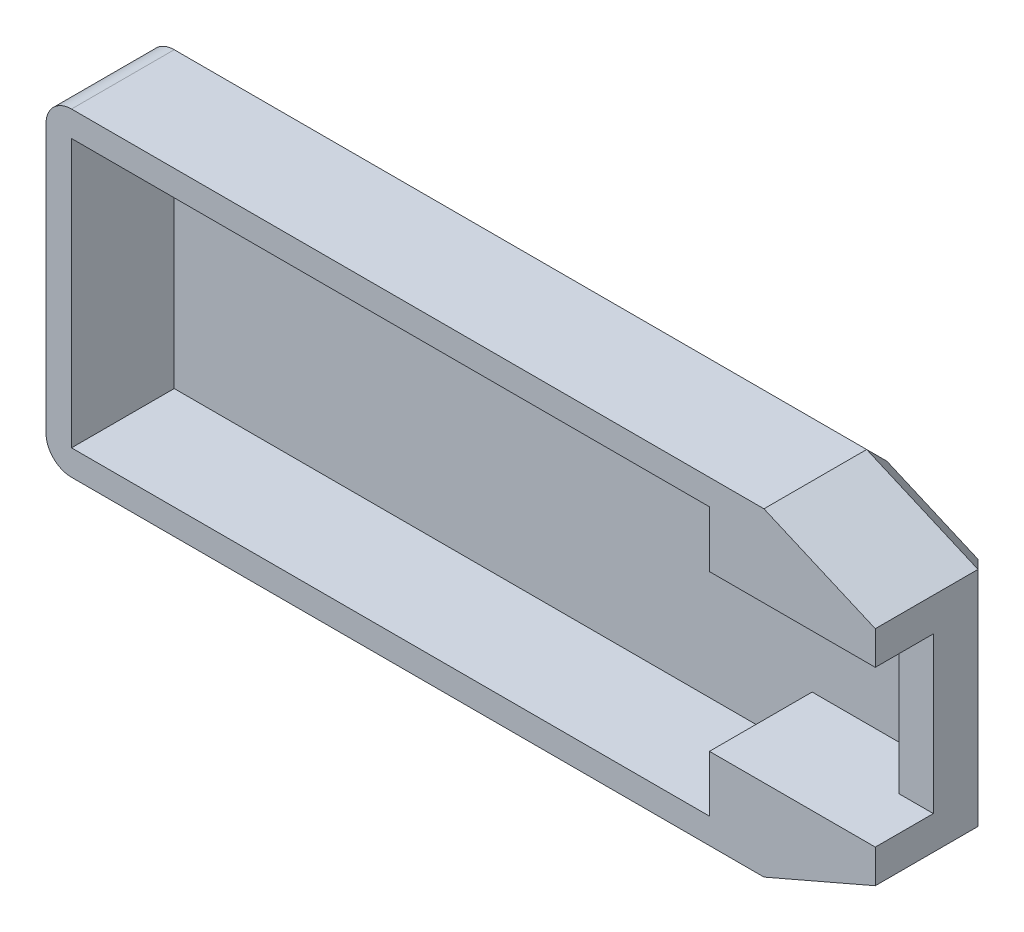
ISO-10303-21;
HEADER;
FILE_DESCRIPTION(('STEP AP214'),'2;1');
FILE_NAME('part.step','',(''),(''),'','','');
FILE_SCHEMA(('AUTOMOTIVE_DESIGN { 1 0 10303 214 1 1 1 1 }'));
ENDSEC;
DATA;
#1=APPLICATION_CONTEXT('core data for automotive mechanical design processes');
#2=APPLICATION_PROTOCOL_DEFINITION('international standard','automotive_design',2000,#1);
#3=PRODUCT_CONTEXT('',#1,'mechanical');
#4=PRODUCT('Part','Part','',(#3));
#5=PRODUCT_RELATED_PRODUCT_CATEGORY('part','',(#4));
#6=PRODUCT_DEFINITION_FORMATION('','',#4);
#7=PRODUCT_DEFINITION_CONTEXT('part definition',#1,'design');
#8=PRODUCT_DEFINITION('design','',#6,#7);
#9=PRODUCT_DEFINITION_SHAPE('','',#8);
#10=(LENGTH_UNIT() NAMED_UNIT(*) SI_UNIT(.MILLI.,.METRE.));
#11=(NAMED_UNIT(*) PLANE_ANGLE_UNIT() SI_UNIT($,.RADIAN.));
#12=(NAMED_UNIT(*) SI_UNIT($,.STERADIAN.) SOLID_ANGLE_UNIT());
#13=UNCERTAINTY_MEASURE_WITH_UNIT(LENGTH_MEASURE(1.E-05),#10,'distance_accuracy_value','');
#14=(GEOMETRIC_REPRESENTATION_CONTEXT(3) GLOBAL_UNCERTAINTY_ASSIGNED_CONTEXT((#13)) GLOBAL_UNIT_ASSIGNED_CONTEXT((#10,
#11,#12)) REPRESENTATION_CONTEXT('',''));
#15=CARTESIAN_POINT('',(0.,0.,0.));
#16=DIRECTION('',(0.,0.,1.));
#17=DIRECTION('',(1.,0.,0.));
#18=AXIS2_PLACEMENT_3D('',#15,#16,#17);
#19=CARTESIAN_POINT('',(-18.703125,13.70078125,2.));
#20=DIRECTION('',(1.,0.,0.));
#21=DIRECTION('',(0.,1.,0.));
#22=AXIS2_PLACEMENT_3D('',#19,#20,#21);
#23=PLANE('',#22);
#24=DIRECTION('',(0.,0.,-1.));
#25=VECTOR('',#24,1.);
#26=CARTESIAN_POINT('',(-18.703125,11.70078125,2.));
#27=LINE('',#26,#25);
#28=CARTESIAN_POINT('',(-18.703125,11.70078125,10.05));
#29=VERTEX_POINT('',#28);
#30=CARTESIAN_POINT('',(-18.703125,11.70078125,2.));
#31=VERTEX_POINT('',#30);
#32=EDGE_CURVE('E300',#29,#31,#27,.T.);
#33=ORIENTED_EDGE('',*,*,#32,.T.);
#34=DIRECTION('',(0.,-1.,0.));
#35=VECTOR('',#34,1.);
#36=CARTESIAN_POINT('',(-18.703125,13.70078125,2.));
#37=LINE('',#36,#35);
#38=CARTESIAN_POINT('',(-18.703125,-9.29921875,2.00000000000001));
#39=VERTEX_POINT('',#38);
#40=EDGE_CURVE('E321',#31,#39,#37,.T.);
#41=ORIENTED_EDGE('',*,*,#40,.T.);
#42=DIRECTION('',(0.,0.,-1.));
#43=VECTOR('',#42,1.);
#44=CARTESIAN_POINT('',(-18.703125,-9.29921875,2.));
#45=LINE('',#44,#43);
#46=CARTESIAN_POINT('',(-18.703125,-9.29921875,10.05));
#47=VERTEX_POINT('',#46);
#48=EDGE_CURVE('E303',#39,#47,#45,.F.);
#49=ORIENTED_EDGE('',*,*,#48,.T.);
#50=DIRECTION('',(0.,-1.,0.));
#51=VECTOR('',#50,1.);
#52=CARTESIAN_POINT('',(-18.703125,13.70078125,10.05));
#53=LINE('',#52,#51);
#54=EDGE_CURVE('E193',#29,#47,#53,.T.);
#55=ORIENTED_EDGE('',*,*,#54,.F.);
#56=EDGE_LOOP('',(#33,#41,#49,#55));
#57=FACE_BOUND('',#56,.T.);
#58=ADVANCED_FACE('F35',(#57),#23,.F.);
#59=CARTESIAN_POINT('',(-18.703125,-11.29921875,2.));
#60=DIRECTION('',(0.,1.,0.));
#61=DIRECTION('',(-1.,0.,0.));
#62=AXIS2_PLACEMENT_3D('',#59,#60,#61);
#63=PLANE('',#62);
#64=DIRECTION('',(0.,0.,-1.));
#65=VECTOR('',#64,1.);
#66=CARTESIAN_POINT('',(-16.703125,-11.29921875,2.));
#67=LINE('',#66,#65);
#68=CARTESIAN_POINT('',(-16.703125,-11.29921875,10.05));
#69=VERTEX_POINT('',#68);
#70=CARTESIAN_POINT('',(-16.703125,-11.29921875,2.));
#71=VERTEX_POINT('',#70);
#72=EDGE_CURVE('E241',#69,#71,#67,.T.);
#73=ORIENTED_EDGE('',*,*,#72,.T.);
#74=DIRECTION('',(1.,0.,0.));
#75=VECTOR('',#74,1.);
#76=CARTESIAN_POINT('',(-18.703125,-11.29921875,2.));
#77=LINE('',#76,#75);
#78=CARTESIAN_POINT('',(37.5703125,-11.29921875,2.));
#79=VERTEX_POINT('',#78);
#80=EDGE_CURVE('E199',#71,#79,#77,.T.);
#81=ORIENTED_EDGE('',*,*,#80,.T.);
#82=DIRECTION('',(0.,0.,-1.));
#83=VECTOR('',#82,1.);
#84=CARTESIAN_POINT('',(37.5703125,-11.29921875,2.));
#85=LINE('',#84,#83);
#86=CARTESIAN_POINT('',(37.5703125,-11.29921875,10.05));
#87=VERTEX_POINT('',#86);
#88=EDGE_CURVE('E196',#87,#79,#85,.T.);
#89=ORIENTED_EDGE('',*,*,#88,.F.);
#90=DIRECTION('',(1.,0.,0.));
#91=VECTOR('',#90,1.);
#92=CARTESIAN_POINT('',(-18.703125,-11.29921875,10.05));
#93=LINE('',#92,#91);
#94=EDGE_CURVE('E181',#69,#87,#93,.T.);
#95=ORIENTED_EDGE('',*,*,#94,.F.);
#96=EDGE_LOOP('',(#73,#81,#89,#95));
#97=FACE_BOUND('',#96,.T.);
#98=ADVANCED_FACE('F197',(#97),#63,.F.);
#99=CARTESIAN_POINT('',(46.296875,-7.52421874999999,2.));
#100=DIRECTION('',(-0.397030883570598,0.91780525030703,0.));
#101=DIRECTION('',(-0.91780525030703,-0.397030883570598,0.));
#102=AXIS2_PLACEMENT_3D('',#99,#100,#101);
#103=PLANE('',#102);
#104=ORIENTED_EDGE('',*,*,#88,.T.);
#105=DIRECTION('',(0.91780525030703,0.397030883570598,0.));
#106=VECTOR('',#105,1.);
#107=CARTESIAN_POINT('',(46.296875,-7.52421874999999,2.));
#108=LINE('',#107,#106);
#109=CARTESIAN_POINT('',(46.296875,-7.52421874999999,2.));
#110=VERTEX_POINT('',#109);
#111=EDGE_CURVE('E45',#79,#110,#108,.T.);
#112=ORIENTED_EDGE('',*,*,#111,.T.);
#113=DIRECTION('',(0.,0.,-1.));
#114=VECTOR('',#113,1.);
#115=CARTESIAN_POINT('',(46.296875,-7.52421874999999,2.));
#116=LINE('',#115,#114);
#117=CARTESIAN_POINT('',(46.296875,-7.52421874999999,10.05));
#118=VERTEX_POINT('',#117);
#119=EDGE_CURVE('E201',#118,#110,#116,.T.);
#120=ORIENTED_EDGE('',*,*,#119,.F.);
#121=DIRECTION('',(0.91780525030703,0.397030883570598,0.));
#122=VECTOR('',#121,1.);
#123=CARTESIAN_POINT('',(37.5703125,-11.29921875,10.05));
#124=LINE('',#123,#122);
#125=EDGE_CURVE('E186',#87,#118,#124,.T.);
#126=ORIENTED_EDGE('',*,*,#125,.F.);
#127=EDGE_LOOP('',(#104,#112,#120,#126));
#128=FACE_BOUND('',#127,.T.);
#129=ADVANCED_FACE('F203',(#128),#103,.F.);
#130=CARTESIAN_POINT('',(46.296875,9.92578124999999,2.));
#131=DIRECTION('',(-1.,0.,0.));
#132=DIRECTION('',(0.,0.,1.));
#133=AXIS2_PLACEMENT_3D('',#130,#131,#132);
#134=PLANE('',#133);
#135=ORIENTED_EDGE('',*,*,#119,.T.);
#136=DIRECTION('',(0.,1.,0.));
#137=VECTOR('',#136,1.);
#138=CARTESIAN_POINT('',(46.296875,9.92578124999999,2.));
#139=LINE('',#138,#137);
#140=CARTESIAN_POINT('',(46.296875,9.92578124999999,2.));
#141=VERTEX_POINT('',#140);
#142=EDGE_CURVE('E346',#110,#141,#139,.T.);
#143=ORIENTED_EDGE('',*,*,#142,.T.);
#144=DIRECTION('',(0.,0.,-1.));
#145=VECTOR('',#144,1.);
#146=CARTESIAN_POINT('',(46.296875,9.92578124999999,2.));
#147=LINE('',#146,#145);
#148=CARTESIAN_POINT('',(46.296875,9.92578124999999,10.05));
#149=VERTEX_POINT('',#148);
#150=EDGE_CURVE('E295',#149,#141,#147,.T.);
#151=ORIENTED_EDGE('',*,*,#150,.F.);
#152=DIRECTION('',(0.,1.,0.));
#153=VECTOR('',#152,1.);
#154=CARTESIAN_POINT('',(46.296875,7.30078125,10.05));
#155=LINE('',#154,#153);
#156=CARTESIAN_POINT('',(46.296875,7.30078125,10.05));
#157=VERTEX_POINT('',#156);
#158=EDGE_CURVE('E229',#157,#149,#155,.T.);
#159=ORIENTED_EDGE('',*,*,#158,.F.);
#160=DIRECTION('',(0.,0.,-1.));
#161=VECTOR('',#160,1.);
#162=CARTESIAN_POINT('',(46.296875,7.30078125,10.05));
#163=LINE('',#162,#161);
#164=CARTESIAN_POINT('',(46.296875,7.30078125,5.5));
#165=VERTEX_POINT('',#164);
#166=EDGE_CURVE('E235',#157,#165,#163,.T.);
#167=ORIENTED_EDGE('',*,*,#166,.T.);
#168=DIRECTION('',(0.,1.,0.));
#169=VECTOR('',#168,1.);
#170=CARTESIAN_POINT('',(46.296875,-7.52421874999999,5.5));
#171=LINE('',#170,#169);
#172=CARTESIAN_POINT('',(46.296875,-4.89921875,5.5));
#173=VERTEX_POINT('',#172);
#174=EDGE_CURVE('E289',#173,#165,#171,.T.);
#175=ORIENTED_EDGE('',*,*,#174,.F.);
#176=DIRECTION('',(0.,0.,-1.));
#177=VECTOR('',#176,1.);
#178=CARTESIAN_POINT('',(46.296875,-4.89921875,10.05));
#179=LINE('',#178,#177);
#180=CARTESIAN_POINT('',(46.296875,-4.89921875,10.05));
#181=VERTEX_POINT('',#180);
#182=EDGE_CURVE('E244',#181,#173,#179,.T.);
#183=ORIENTED_EDGE('',*,*,#182,.F.);
#184=DIRECTION('',(0.,1.,0.));
#185=VECTOR('',#184,1.);
#186=CARTESIAN_POINT('',(46.296875,-7.52421874999999,10.05));
#187=LINE('',#186,#185);
#188=EDGE_CURVE('E204',#118,#181,#187,.T.);
#189=ORIENTED_EDGE('',*,*,#188,.F.);
#190=EDGE_LOOP('',(#135,#143,#151,#159,#167,#175,#183,#189));
#191=FACE_BOUND('',#190,.T.);
#192=ADVANCED_FACE('F404',(#191),#134,.F.);
#193=CARTESIAN_POINT('',(46.296875,9.92578124999999,2.));
#194=DIRECTION('',(-0.397030883570599,-0.91780525030703,0.));
#195=DIRECTION('',(0.91780525030703,-0.397030883570599,0.));
#196=AXIS2_PLACEMENT_3D('',#193,#194,#195);
#197=PLANE('',#196);
#198=ORIENTED_EDGE('',*,*,#150,.T.);
#199=DIRECTION('',(-0.91780525030703,0.397030883570599,0.));
#200=VECTOR('',#199,1.);
#201=CARTESIAN_POINT('',(46.296875,9.92578124999999,2.));
#202=LINE('',#201,#200);
#203=CARTESIAN_POINT('',(37.5703125,13.70078125,2.));
#204=VERTEX_POINT('',#203);
#205=EDGE_CURVE('E326',#141,#204,#202,.T.);
#206=ORIENTED_EDGE('',*,*,#205,.T.);
#207=DIRECTION('',(0.,0.,-1.));
#208=VECTOR('',#207,1.);
#209=CARTESIAN_POINT('',(37.5703125,13.70078125,2.));
#210=LINE('',#209,#208);
#211=CARTESIAN_POINT('',(37.5703125,13.70078125,10.05));
#212=VERTEX_POINT('',#211);
#213=EDGE_CURVE('E292',#212,#204,#210,.T.);
#214=ORIENTED_EDGE('',*,*,#213,.F.);
#215=DIRECTION('',(-0.91780525030703,0.397030883570599,0.));
#216=VECTOR('',#215,1.);
#217=CARTESIAN_POINT('',(46.296875,9.92578124999999,10.05));
#218=LINE('',#217,#216);
#219=EDGE_CURVE('E232',#149,#212,#218,.T.);
#220=ORIENTED_EDGE('',*,*,#219,.F.);
#221=EDGE_LOOP('',(#198,#206,#214,#220));
#222=FACE_BOUND('',#221,.T.);
#223=ADVANCED_FACE('F381',(#222),#197,.F.);
#224=CARTESIAN_POINT('',(-18.703125,13.70078125,2.));
#225=DIRECTION('',(0.,-1.,0.));
#226=DIRECTION('',(1.,0.,0.));
#227=AXIS2_PLACEMENT_3D('',#224,#225,#226);
#228=PLANE('',#227);
#229=ORIENTED_EDGE('',*,*,#213,.T.);
#230=DIRECTION('',(-1.,0.,0.));
#231=VECTOR('',#230,1.);
#232=CARTESIAN_POINT('',(-18.703125,13.70078125,2.));
#233=LINE('',#232,#231);
#234=CARTESIAN_POINT('',(-16.703125,13.70078125,2.00000000000001));
#235=VERTEX_POINT('',#234);
#236=EDGE_CURVE('E310',#204,#235,#233,.T.);
#237=ORIENTED_EDGE('',*,*,#236,.T.);
#238=DIRECTION('',(0.,0.,-1.));
#239=VECTOR('',#238,1.);
#240=CARTESIAN_POINT('',(-16.703125,13.70078125,2.));
#241=LINE('',#240,#239);
#242=CARTESIAN_POINT('',(-16.703125,13.70078125,10.05));
#243=VERTEX_POINT('',#242);
#244=EDGE_CURVE('E308',#235,#243,#241,.F.);
#245=ORIENTED_EDGE('',*,*,#244,.T.);
#246=DIRECTION('',(-1.,0.,0.));
#247=VECTOR('',#246,1.);
#248=CARTESIAN_POINT('',(37.5703125,13.70078125,10.05));
#249=LINE('',#248,#247);
#250=EDGE_CURVE('E238',#212,#243,#249,.T.);
#251=ORIENTED_EDGE('',*,*,#250,.F.);
#252=EDGE_LOOP('',(#229,#237,#245,#251));
#253=FACE_BOUND('',#252,.T.);
#254=ADVANCED_FACE('F385',(#253),#228,.F.);
#255=CARTESIAN_POINT('',(0.,0.,0.));
#256=DIRECTION('',(0.,0.,1.));
#257=DIRECTION('',(1.,0.,0.));
#258=AXIS2_PLACEMENT_3D('',#255,#256,#257);
#259=PLANE('',#258);
#260=DIRECTION('',(1.,0.,0.));
#261=VECTOR('',#260,1.);
#262=CARTESIAN_POINT('',(0.,11.70078125,0.));
#263=LINE('',#262,#261);
#264=CARTESIAN_POINT('',(-16.703125,11.70078125,0.));
#265=VERTEX_POINT('',#264);
#266=CARTESIAN_POINT('',(37.1562653661661,11.70078125,0.));
#267=VERTEX_POINT('',#266);
#268=EDGE_CURVE('E317',#265,#267,#263,.T.);
#269=ORIENTED_EDGE('',*,*,#268,.T.);
#270=DIRECTION('',(0.91780525030703,-0.397030883570599,0.));
#271=VECTOR('',#270,1.);
#272=CARTESIAN_POINT('',(10.1208029229807,23.3959786112778,0.));
#273=LINE('',#272,#271);
#274=CARTESIAN_POINT('',(44.296875,8.6118442982824,0.));
#275=VERTEX_POINT('',#274);
#276=EDGE_CURVE('E60',#267,#275,#273,.T.);
#277=ORIENTED_EDGE('',*,*,#276,.T.);
#278=DIRECTION('',(0.,-1.,0.));
#279=VECTOR('',#278,1.);
#280=CARTESIAN_POINT('',(44.296875,0.,0.));
#281=LINE('',#280,#279);
#282=CARTESIAN_POINT('',(44.296875,-6.21028179828241,0.));
#283=VERTEX_POINT('',#282);
#284=EDGE_CURVE('E343',#275,#283,#281,.T.);
#285=ORIENTED_EDGE('',*,*,#284,.T.);
#286=DIRECTION('',(-0.91780525030703,-0.397030883570598,0.));
#287=VECTOR('',#286,1.);
#288=CARTESIAN_POINT('',(9.24568068188182,-21.3729828676779,0.));
#289=LINE('',#288,#287);
#290=CARTESIAN_POINT('',(37.1562653661661,-9.29921874999999,0.));
#291=VERTEX_POINT('',#290);
#292=EDGE_CURVE('E341',#283,#291,#289,.T.);
#293=ORIENTED_EDGE('',*,*,#292,.T.);
#294=DIRECTION('',(-1.,0.,0.));
#295=VECTOR('',#294,1.);
#296=CARTESIAN_POINT('',(0.,-9.29921874999998,0.));
#297=LINE('',#296,#295);
#298=CARTESIAN_POINT('',(-16.703125,-9.29921874999998,0.));
#299=VERTEX_POINT('',#298);
#300=EDGE_CURVE('E313',#291,#299,#297,.T.);
#301=ORIENTED_EDGE('',*,*,#300,.T.);
#302=DIRECTION('',(0.,1.,0.));
#303=VECTOR('',#302,1.);
#304=CARTESIAN_POINT('',(-16.703125,0.,0.));
#305=LINE('',#304,#303);
#306=EDGE_CURVE('E315',#299,#265,#305,.T.);
#307=ORIENTED_EDGE('',*,*,#306,.T.);
#308=EDGE_LOOP('',(#269,#277,#285,#293,#301,#307));
#309=FACE_BOUND('',#308,.T.);
#310=ADVANCED_FACE('F362',(#309),#259,.F.);
#311=CARTESIAN_POINT('',(0.,0.,5.5));
#312=DIRECTION('',(0.,0.,1.));
#313=DIRECTION('',(1.,0.,0.));
#314=AXIS2_PLACEMENT_3D('',#311,#312,#313);
#315=PLANE('',#314);
#316=DIRECTION('',(1.,0.,0.));
#317=VECTOR('',#316,1.);
#318=CARTESIAN_POINT('',(46.296875,7.30078125,5.5));
#319=LINE('',#318,#317);
#320=CARTESIAN_POINT('',(43.596875,7.30078125,5.5));
#321=VERTEX_POINT('',#320);
#322=EDGE_CURVE('E200',#321,#165,#319,.T.);
#323=ORIENTED_EDGE('',*,*,#322,.F.);
#324=DIRECTION('',(0.,1.,0.));
#325=VECTOR('',#324,1.);
#326=CARTESIAN_POINT('',(43.596875,-4.89921875,5.5));
#327=LINE('',#326,#325);
#328=CARTESIAN_POINT('',(43.596875,-4.89921875,5.5));
#329=VERTEX_POINT('',#328);
#330=EDGE_CURVE('E247',#329,#321,#327,.T.);
#331=ORIENTED_EDGE('',*,*,#330,.F.);
#332=DIRECTION('',(-1.,0.,0.));
#333=VECTOR('',#332,1.);
#334=CARTESIAN_POINT('',(33.296875,-4.89921875,5.5));
#335=LINE('',#334,#333);
#336=EDGE_CURVE('E236',#173,#329,#335,.T.);
#337=ORIENTED_EDGE('',*,*,#336,.F.);
#338=ORIENTED_EDGE('',*,*,#174,.T.);
#339=EDGE_LOOP('',(#323,#331,#337,#338));
#340=FACE_BOUND('',#339,.T.);
#341=ADVANCED_FACE('F436',(#340),#315,.T.);
#342=CARTESIAN_POINT('',(-16.703125,11.70078125,5.5));
#343=DIRECTION('',(1.,0.,0.));
#344=DIRECTION('',(0.,1.,0.));
#345=AXIS2_PLACEMENT_3D('',#342,#343,#344);
#346=PLANE('',#345);
#347=DIRECTION('',(0.,-1.,0.));
#348=VECTOR('',#347,1.);
#349=CARTESIAN_POINT('',(-16.703125,11.70078125,2.));
#350=LINE('',#349,#348);
#351=CARTESIAN_POINT('',(-16.703125,11.70078125,2.));
#352=VERTEX_POINT('',#351);
#353=CARTESIAN_POINT('',(-16.703125,-9.29921875,2.));
#354=VERTEX_POINT('',#353);
#355=EDGE_CURVE('E246',#352,#354,#350,.T.);
#356=ORIENTED_EDGE('',*,*,#355,.F.);
#357=DIRECTION('',(0.,0.,-1.));
#358=VECTOR('',#357,1.);
#359=CARTESIAN_POINT('',(-16.703125,11.70078125,5.5));
#360=LINE('',#359,#358);
#361=CARTESIAN_POINT('',(-16.703125,11.70078125,10.05));
#362=VERTEX_POINT('',#361);
#363=EDGE_CURVE('E250',#362,#352,#360,.T.);
#364=ORIENTED_EDGE('',*,*,#363,.F.);
#365=DIRECTION('',(0.,1.,0.));
#366=VECTOR('',#365,1.);
#367=CARTESIAN_POINT('',(-16.703125,11.70078125,10.05));
#368=LINE('',#367,#366);
#369=CARTESIAN_POINT('',(-16.703125,-9.29921875,10.05));
#370=VERTEX_POINT('',#369);
#371=EDGE_CURVE('E218',#370,#362,#368,.T.);
#372=ORIENTED_EDGE('',*,*,#371,.F.);
#373=DIRECTION('',(0.,0.,-1.));
#374=VECTOR('',#373,1.);
#375=CARTESIAN_POINT('',(-16.703125,-9.29921875,5.5));
#376=LINE('',#375,#374);
#377=EDGE_CURVE('E286',#370,#354,#376,.T.);
#378=ORIENTED_EDGE('',*,*,#377,.T.);
#379=EDGE_LOOP('',(#356,#364,#372,#378));
#380=FACE_BOUND('',#379,.T.);
#381=ADVANCED_FACE('F422',(#380),#346,.T.);
#382=CARTESIAN_POINT('',(-16.703125,-9.29921875,5.5));
#383=DIRECTION('',(0.,1.,0.));
#384=DIRECTION('',(0.,0.,1.));
#385=AXIS2_PLACEMENT_3D('',#382,#383,#384);
#386=PLANE('',#385);
#387=DIRECTION('',(1.,0.,0.));
#388=VECTOR('',#387,1.);
#389=CARTESIAN_POINT('',(-16.703125,-9.29921875,2.));
#390=LINE('',#389,#388);
#391=CARTESIAN_POINT('',(33.296875,-9.29921875,2.));
#392=VERTEX_POINT('',#391);
#393=EDGE_CURVE('E253',#354,#392,#390,.T.);
#394=ORIENTED_EDGE('',*,*,#393,.F.);
#395=ORIENTED_EDGE('',*,*,#377,.F.);
#396=DIRECTION('',(-1.,0.,0.));
#397=VECTOR('',#396,1.);
#398=CARTESIAN_POINT('',(-16.703125,-9.29921875,10.05));
#399=LINE('',#398,#397);
#400=CARTESIAN_POINT('',(33.296875,-9.29921875,10.05));
#401=VERTEX_POINT('',#400);
#402=EDGE_CURVE('E215',#401,#370,#399,.T.);
#403=ORIENTED_EDGE('',*,*,#402,.F.);
#404=DIRECTION('',(0.,0.,-1.));
#405=VECTOR('',#404,1.);
#406=CARTESIAN_POINT('',(33.296875,-9.29921875,5.5));
#407=LINE('',#406,#405);
#408=EDGE_CURVE('E283',#401,#392,#407,.T.);
#409=ORIENTED_EDGE('',*,*,#408,.T.);
#410=EDGE_LOOP('',(#394,#395,#403,#409));
#411=FACE_BOUND('',#410,.T.);
#412=ADVANCED_FACE('F417',(#411),#386,.T.);
#413=CARTESIAN_POINT('',(33.296875,-4.89921875,5.5));
#414=DIRECTION('',(-1.,0.,0.));
#415=DIRECTION('',(0.,0.,1.));
#416=AXIS2_PLACEMENT_3D('',#413,#414,#415);
#417=PLANE('',#416);
#418=DIRECTION('',(0.,1.,0.));
#419=VECTOR('',#418,1.);
#420=CARTESIAN_POINT('',(33.296875,-4.89921875,2.));
#421=LINE('',#420,#419);
#422=CARTESIAN_POINT('',(33.296875,-4.89921875,2.));
#423=VERTEX_POINT('',#422);
#424=EDGE_CURVE('E255',#392,#423,#421,.T.);
#425=ORIENTED_EDGE('',*,*,#424,.F.);
#426=ORIENTED_EDGE('',*,*,#408,.F.);
#427=DIRECTION('',(0.,-1.,0.));
#428=VECTOR('',#427,1.);
#429=CARTESIAN_POINT('',(33.296875,-9.29921875,10.05));
#430=LINE('',#429,#428);
#431=CARTESIAN_POINT('',(33.296875,-4.89921875,10.05));
#432=VERTEX_POINT('',#431);
#433=EDGE_CURVE('E212',#432,#401,#430,.T.);
#434=ORIENTED_EDGE('',*,*,#433,.F.);
#435=DIRECTION('',(0.,0.,-1.));
#436=VECTOR('',#435,1.);
#437=CARTESIAN_POINT('',(33.296875,-4.89921875,5.5));
#438=LINE('',#437,#436);
#439=EDGE_CURVE('E280',#432,#423,#438,.T.);
#440=ORIENTED_EDGE('',*,*,#439,.T.);
#441=EDGE_LOOP('',(#425,#426,#434,#440));
#442=FACE_BOUND('',#441,.T.);
#443=ADVANCED_FACE('F413',(#442),#417,.T.);
#444=CARTESIAN_POINT('',(43.596875,-4.89921875,5.5));
#445=DIRECTION('',(0.,1.,0.));
#446=DIRECTION('',(-1.,0.,0.));
#447=AXIS2_PLACEMENT_3D('',#444,#445,#446);
#448=PLANE('',#447);
#449=DIRECTION('',(1.,0.,0.));
#450=VECTOR('',#449,1.);
#451=CARTESIAN_POINT('',(43.596875,-4.89921875,2.));
#452=LINE('',#451,#450);
#453=CARTESIAN_POINT('',(43.596875,-4.89921875,2.));
#454=VERTEX_POINT('',#453);
#455=EDGE_CURVE('E257',#423,#454,#452,.T.);
#456=ORIENTED_EDGE('',*,*,#455,.F.);
#457=ORIENTED_EDGE('',*,*,#439,.F.);
#458=DIRECTION('',(-1.,0.,0.));
#459=VECTOR('',#458,1.);
#460=CARTESIAN_POINT('',(33.296875,-4.89921875,10.05));
#461=LINE('',#460,#459);
#462=EDGE_CURVE('E206',#181,#432,#461,.T.);
#463=ORIENTED_EDGE('',*,*,#462,.F.);
#464=ORIENTED_EDGE('',*,*,#182,.T.);
#465=ORIENTED_EDGE('',*,*,#336,.T.);
#466=DIRECTION('',(0.,0.,-1.));
#467=VECTOR('',#466,1.);
#468=CARTESIAN_POINT('',(43.596875,-4.89921875,5.5));
#469=LINE('',#468,#467);
#470=EDGE_CURVE('E277',#329,#454,#469,.T.);
#471=ORIENTED_EDGE('',*,*,#470,.T.);
#472=EDGE_LOOP('',(#456,#457,#463,#464,#465,#471));
#473=FACE_BOUND('',#472,.T.);
#474=ADVANCED_FACE('F442',(#473),#448,.T.);
#475=CARTESIAN_POINT('',(43.596875,-4.89921875,5.5));
#476=DIRECTION('',(-1.,0.,0.));
#477=DIRECTION('',(0.,-1.,0.));
#478=AXIS2_PLACEMENT_3D('',#475,#476,#477);
#479=PLANE('',#478);
#480=DIRECTION('',(0.,1.,0.));
#481=VECTOR('',#480,1.);
#482=CARTESIAN_POINT('',(43.596875,-4.89921875,2.));
#483=LINE('',#482,#481);
#484=CARTESIAN_POINT('',(43.596875,7.30078125,2.));
#485=VERTEX_POINT('',#484);
#486=EDGE_CURVE('E259',#454,#485,#483,.T.);
#487=ORIENTED_EDGE('',*,*,#486,.F.);
#488=ORIENTED_EDGE('',*,*,#470,.F.);
#489=ORIENTED_EDGE('',*,*,#330,.T.);
#490=DIRECTION('',(0.,0.,-1.));
#491=VECTOR('',#490,1.);
#492=CARTESIAN_POINT('',(43.596875,7.30078125,5.5));
#493=LINE('',#492,#491);
#494=EDGE_CURVE('E274',#321,#485,#493,.T.);
#495=ORIENTED_EDGE('',*,*,#494,.T.);
#496=EDGE_LOOP('',(#487,#488,#489,#495));
#497=FACE_BOUND('',#496,.T.);
#498=ADVANCED_FACE('F441',(#497),#479,.T.);
#499=CARTESIAN_POINT('',(43.596875,7.30078125,5.5));
#500=DIRECTION('',(0.,-1.,0.));
#501=DIRECTION('',(1.,0.,0.));
#502=AXIS2_PLACEMENT_3D('',#499,#500,#501);
#503=PLANE('',#502);
#504=DIRECTION('',(-1.,0.,0.));
#505=VECTOR('',#504,1.);
#506=CARTESIAN_POINT('',(43.596875,7.30078125,2.));
#507=LINE('',#506,#505);
#508=CARTESIAN_POINT('',(33.296875,7.30078125,2.));
#509=VERTEX_POINT('',#508);
#510=EDGE_CURVE('E261',#485,#509,#507,.T.);
#511=ORIENTED_EDGE('',*,*,#510,.F.);
#512=ORIENTED_EDGE('',*,*,#494,.F.);
#513=ORIENTED_EDGE('',*,*,#322,.T.);
#514=ORIENTED_EDGE('',*,*,#166,.F.);
#515=DIRECTION('',(1.,0.,0.));
#516=VECTOR('',#515,1.);
#517=CARTESIAN_POINT('',(46.296875,7.30078125,10.05));
#518=LINE('',#517,#516);
#519=CARTESIAN_POINT('',(33.296875,7.30078125,10.05));
#520=VERTEX_POINT('',#519);
#521=EDGE_CURVE('E227',#520,#157,#518,.T.);
#522=ORIENTED_EDGE('',*,*,#521,.F.);
#523=DIRECTION('',(0.,0.,-1.));
#524=VECTOR('',#523,1.);
#525=CARTESIAN_POINT('',(33.296875,7.30078125,5.5));
#526=LINE('',#525,#524);
#527=EDGE_CURVE('E271',#520,#509,#526,.T.);
#528=ORIENTED_EDGE('',*,*,#527,.T.);
#529=EDGE_LOOP('',(#511,#512,#513,#514,#522,#528));
#530=FACE_BOUND('',#529,.T.);
#531=ADVANCED_FACE('F432',(#530),#503,.T.);
#532=CARTESIAN_POINT('',(33.296875,11.70078125,5.5));
#533=DIRECTION('',(-1.,0.,0.));
#534=DIRECTION('',(0.,0.,1.));
#535=AXIS2_PLACEMENT_3D('',#532,#533,#534);
#536=PLANE('',#535);
#537=DIRECTION('',(0.,1.,0.));
#538=VECTOR('',#537,1.);
#539=CARTESIAN_POINT('',(33.296875,11.70078125,2.));
#540=LINE('',#539,#538);
#541=CARTESIAN_POINT('',(33.296875,11.70078125,2.));
#542=VERTEX_POINT('',#541);
#543=EDGE_CURVE('E263',#509,#542,#540,.T.);
#544=ORIENTED_EDGE('',*,*,#543,.F.);
#545=ORIENTED_EDGE('',*,*,#527,.F.);
#546=DIRECTION('',(0.,-1.,0.));
#547=VECTOR('',#546,1.);
#548=CARTESIAN_POINT('',(33.296875,7.30078125,10.05));
#549=LINE('',#548,#547);
#550=CARTESIAN_POINT('',(33.296875,11.70078125,10.05));
#551=VERTEX_POINT('',#550);
#552=EDGE_CURVE('E224',#551,#520,#549,.T.);
#553=ORIENTED_EDGE('',*,*,#552,.F.);
#554=DIRECTION('',(0.,0.,-1.));
#555=VECTOR('',#554,1.);
#556=CARTESIAN_POINT('',(33.296875,11.70078125,5.5));
#557=LINE('',#556,#555);
#558=EDGE_CURVE('E268',#551,#542,#557,.T.);
#559=ORIENTED_EDGE('',*,*,#558,.T.);
#560=EDGE_LOOP('',(#544,#545,#553,#559));
#561=FACE_BOUND('',#560,.T.);
#562=ADVANCED_FACE('F429',(#561),#536,.T.);
#563=CARTESIAN_POINT('',(-16.703125,11.70078125,5.5));
#564=DIRECTION('',(0.,-1.,0.));
#565=DIRECTION('',(0.,0.,-1.));
#566=AXIS2_PLACEMENT_3D('',#563,#564,#565);
#567=PLANE('',#566);
#568=DIRECTION('',(-1.,0.,0.));
#569=VECTOR('',#568,1.);
#570=CARTESIAN_POINT('',(-16.703125,11.70078125,2.));
#571=LINE('',#570,#569);
#572=EDGE_CURVE('E251',#542,#352,#571,.T.);
#573=ORIENTED_EDGE('',*,*,#572,.F.);
#574=ORIENTED_EDGE('',*,*,#558,.F.);
#575=DIRECTION('',(1.,0.,0.));
#576=VECTOR('',#575,1.);
#577=CARTESIAN_POINT('',(33.296875,11.70078125,10.05));
#578=LINE('',#577,#576);
#579=EDGE_CURVE('E221',#362,#551,#578,.T.);
#580=ORIENTED_EDGE('',*,*,#579,.F.);
#581=ORIENTED_EDGE('',*,*,#363,.T.);
#582=EDGE_LOOP('',(#573,#574,#580,#581));
#583=FACE_BOUND('',#582,.T.);
#584=ADVANCED_FACE('F425',(#583),#567,.T.);
#585=CARTESIAN_POINT('',(0.,0.,2.));
#586=DIRECTION('',(0.,0.,1.));
#587=DIRECTION('',(1.,0.,0.));
#588=AXIS2_PLACEMENT_3D('',#585,#586,#587);
#589=PLANE('',#588);
#590=ORIENTED_EDGE('',*,*,#355,.T.);
#591=ORIENTED_EDGE('',*,*,#393,.T.);
#592=ORIENTED_EDGE('',*,*,#424,.T.);
#593=ORIENTED_EDGE('',*,*,#455,.T.);
#594=ORIENTED_EDGE('',*,*,#486,.T.);
#595=ORIENTED_EDGE('',*,*,#510,.T.);
#596=ORIENTED_EDGE('',*,*,#543,.T.);
#597=ORIENTED_EDGE('',*,*,#572,.T.);
#598=EDGE_LOOP('',(#590,#591,#592,#593,#594,#595,#596,#597));
#599=FACE_BOUND('',#598,.T.);
#600=ADVANCED_FACE('F444',(#599),#589,.T.);
#601=CARTESIAN_POINT('',(0.,0.,10.05));
#602=DIRECTION('',(0.,0.,1.));
#603=DIRECTION('',(1.,0.,0.));
#604=AXIS2_PLACEMENT_3D('',#601,#602,#603);
#605=PLANE('',#604);
#606=ORIENTED_EDGE('',*,*,#54,.T.);
#607=CARTESIAN_POINT('',(-16.703125,-9.29921875,10.05));
#608=DIRECTION('',(0.,0.,1.));
#609=DIRECTION('',(1.,0.,0.));
#610=AXIS2_PLACEMENT_3D('',#607,#608,#609);
#611=CIRCLE('',#610,2.);
#612=EDGE_CURVE('E189',#47,#69,#611,.T.);
#613=ORIENTED_EDGE('',*,*,#612,.T.);
#614=ORIENTED_EDGE('',*,*,#94,.T.);
#615=ORIENTED_EDGE('',*,*,#125,.T.);
#616=ORIENTED_EDGE('',*,*,#188,.T.);
#617=ORIENTED_EDGE('',*,*,#462,.T.);
#618=ORIENTED_EDGE('',*,*,#433,.T.);
#619=ORIENTED_EDGE('',*,*,#402,.T.);
#620=ORIENTED_EDGE('',*,*,#371,.T.);
#621=ORIENTED_EDGE('',*,*,#579,.T.);
#622=ORIENTED_EDGE('',*,*,#552,.T.);
#623=ORIENTED_EDGE('',*,*,#521,.T.);
#624=ORIENTED_EDGE('',*,*,#158,.T.);
#625=ORIENTED_EDGE('',*,*,#219,.T.);
#626=ORIENTED_EDGE('',*,*,#250,.T.);
#627=CARTESIAN_POINT('',(-16.703125,11.70078125,10.05));
#628=DIRECTION('',(0.,0.,1.));
#629=DIRECTION('',(1.,0.,0.));
#630=AXIS2_PLACEMENT_3D('',#627,#628,#629);
#631=CIRCLE('',#630,2.);
#632=EDGE_CURVE('E305',#243,#29,#631,.T.);
#633=ORIENTED_EDGE('',*,*,#632,.T.);
#634=EDGE_LOOP('',(#606,#613,#614,#615,#616,#617,#618,#619,#620,#621,#622,#623,#624,#625,#626,#633));
#635=FACE_BOUND('',#634,.T.);
#636=ADVANCED_FACE('F184',(#635),#605,.T.);
#637=CARTESIAN_POINT('',(-16.703125,-9.29921875,2.));
#638=DIRECTION('',(0.,0.,-1.));
#639=DIRECTION('',(-1.,0.,0.));
#640=AXIS2_PLACEMENT_3D('',#637,#638,#639);
#641=CYLINDRICAL_SURFACE('',#640,2.);
#642=ORIENTED_EDGE('',*,*,#48,.F.);
#643=CARTESIAN_POINT('',(-16.703125,-9.29921875,2.00000000000001));
#644=DIRECTION('',(0.,0.,1.));
#645=DIRECTION('',(1.,0.,0.));
#646=AXIS2_PLACEMENT_3D('',#643,#644,#645);
#647=CIRCLE('',#646,2.);
#648=EDGE_CURVE('E323',#39,#71,#647,.T.);
#649=ORIENTED_EDGE('',*,*,#648,.T.);
#650=ORIENTED_EDGE('',*,*,#72,.F.);
#651=ORIENTED_EDGE('',*,*,#612,.F.);
#652=EDGE_LOOP('',(#642,#649,#650,#651));
#653=FACE_BOUND('',#652,.T.);
#654=ADVANCED_FACE('F451',(#653),#641,.T.);
#655=CARTESIAN_POINT('',(-16.703125,11.70078125,2.));
#656=DIRECTION('',(0.,0.,-1.));
#657=DIRECTION('',(-1.,0.,0.));
#658=AXIS2_PLACEMENT_3D('',#655,#656,#657);
#659=CYLINDRICAL_SURFACE('',#658,2.);
#660=ORIENTED_EDGE('',*,*,#244,.F.);
#661=CARTESIAN_POINT('',(-16.703125,11.70078125,2.00000000000001));
#662=DIRECTION('',(0.,0.,1.));
#663=DIRECTION('',(1.,0.,0.));
#664=AXIS2_PLACEMENT_3D('',#661,#662,#663);
#665=CIRCLE('',#664,2.);
#666=EDGE_CURVE('E319',#235,#31,#665,.T.);
#667=ORIENTED_EDGE('',*,*,#666,.T.);
#668=ORIENTED_EDGE('',*,*,#32,.F.);
#669=ORIENTED_EDGE('',*,*,#632,.F.);
#670=EDGE_LOOP('',(#660,#667,#668,#669));
#671=FACE_BOUND('',#670,.T.);
#672=ADVANCED_FACE('F394',(#671),#659,.T.);
#673=CARTESIAN_POINT('',(-18.703125,-11.29921875,2.));
#674=DIRECTION('',(0.,0.707106781186545,0.70710678118655));
#675=DIRECTION('',(1.,0.,0.));
#676=AXIS2_PLACEMENT_3D('',#673,#674,#675);
#677=PLANE('',#676);
#678=ORIENTED_EDGE('',*,*,#300,.F.);
#679=DIRECTION('',(0.14484403565918,-0.699649985826474,0.699649985826468));
#680=VECTOR('',#679,1.);
#681=CARTESIAN_POINT('',(36.3897073360979,-5.5964614191121,-3.70275733088785));
#682=LINE('',#681,#680);
#683=EDGE_CURVE('E11',#291,#79,#682,.T.);
#684=ORIENTED_EDGE('',*,*,#683,.T.);
#685=ORIENTED_EDGE('',*,*,#80,.F.);
#686=DIRECTION('',(0.,-0.70710678118655,0.707106781186545));
#687=VECTOR('',#686,1.);
#688=CARTESIAN_POINT('',(-16.703125,-9.29921874999998,0.));
#689=LINE('',#688,#687);
#690=EDGE_CURVE('E239',#299,#71,#689,.T.);
#691=ORIENTED_EDGE('',*,*,#690,.F.);
#692=EDGE_LOOP('',(#678,#684,#685,#691));
#693=FACE_BOUND('',#692,.T.);
#694=ADVANCED_FACE('F365',(#693),#677,.F.);
#695=CARTESIAN_POINT('',(-16.703125,-9.29921875,2.00000000000001));
#696=DIRECTION('',(0.,0.,1.));
#697=DIRECTION('',(1.,0.,0.));
#698=AXIS2_PLACEMENT_3D('',#695,#696,#697);
#699=CONICAL_SURFACE('',#698,2.00000000000002,0.78539816339745);
#700=ORIENTED_EDGE('',*,*,#690,.T.);
#701=ORIENTED_EDGE('',*,*,#648,.F.);
#702=DIRECTION('',(-0.707106781186549,0.,0.707106781186546));
#703=VECTOR('',#702,1.);
#704=CARTESIAN_POINT('',(-16.703125,-9.29921875,0.));
#705=LINE('',#704,#703);
#706=EDGE_CURVE('E332',#299,#39,#705,.T.);
#707=ORIENTED_EDGE('',*,*,#706,.F.);
#708=EDGE_LOOP('',(#700,#701,#707));
#709=FACE_BOUND('',#708,.T.);
#710=ADVANCED_FACE('F370',(#709),#699,.T.);
#711=CARTESIAN_POINT('',(-18.703125,13.70078125,2.));
#712=DIRECTION('',(0.707106781186545,0.,0.70710678118655));
#713=DIRECTION('',(0.,-1.,0.));
#714=AXIS2_PLACEMENT_3D('',#711,#712,#713);
#715=PLANE('',#714);
#716=ORIENTED_EDGE('',*,*,#706,.T.);
#717=ORIENTED_EDGE('',*,*,#40,.F.);
#718=DIRECTION('',(-0.70710678118655,0.,0.707106781186545));
#719=VECTOR('',#718,1.);
#720=CARTESIAN_POINT('',(-16.703125,11.70078125,0.));
#721=LINE('',#720,#719);
#722=EDGE_CURVE('E329',#265,#31,#721,.T.);
#723=ORIENTED_EDGE('',*,*,#722,.F.);
#724=ORIENTED_EDGE('',*,*,#306,.F.);
#725=EDGE_LOOP('',(#716,#717,#723,#724));
#726=FACE_BOUND('',#725,.T.);
#727=ADVANCED_FACE('F374',(#726),#715,.F.);
#728=CARTESIAN_POINT('',(-16.703125,11.70078125,2.00000000000001));
#729=DIRECTION('',(0.,0.,1.));
#730=DIRECTION('',(1.,0.,0.));
#731=AXIS2_PLACEMENT_3D('',#728,#729,#730);
#732=CONICAL_SURFACE('',#731,2.00000000000002,0.78539816339745);
#733=ORIENTED_EDGE('',*,*,#722,.T.);
#734=ORIENTED_EDGE('',*,*,#666,.F.);
#735=DIRECTION('',(0.,0.707106781186549,0.707106781186546));
#736=VECTOR('',#735,1.);
#737=CARTESIAN_POINT('',(-16.703125,11.70078125,0.));
#738=LINE('',#737,#736);
#739=EDGE_CURVE('E327',#265,#235,#738,.T.);
#740=ORIENTED_EDGE('',*,*,#739,.F.);
#741=EDGE_LOOP('',(#733,#734,#740));
#742=FACE_BOUND('',#741,.T.);
#743=ADVANCED_FACE('F391',(#742),#732,.T.);
#744=CARTESIAN_POINT('',(-18.703125,13.70078125,2.));
#745=DIRECTION('',(0.,-0.707106781186545,0.70710678118655));
#746=DIRECTION('',(-1.,0.,0.));
#747=AXIS2_PLACEMENT_3D('',#744,#745,#746);
#748=PLANE('',#747);
#749=ORIENTED_EDGE('',*,*,#236,.F.);
#750=DIRECTION('',(-0.144844035659183,-0.699649985826474,-0.699649985826468));
#751=VECTOR('',#750,1.);
#752=CARTESIAN_POINT('',(36.3897073360978,7.99802391911201,-3.70275733088796));
#753=LINE('',#752,#751);
#754=EDGE_CURVE('E339',#204,#267,#753,.T.);
#755=ORIENTED_EDGE('',*,*,#754,.T.);
#756=ORIENTED_EDGE('',*,*,#268,.F.);
#757=ORIENTED_EDGE('',*,*,#739,.T.);
#758=EDGE_LOOP('',(#749,#755,#756,#757));
#759=FACE_BOUND('',#758,.T.);
#760=ADVANCED_FACE('F388',(#759),#748,.F.);
#761=CARTESIAN_POINT('',(46.296875,-7.52421874999999,2.));
#762=DIRECTION('',(-0.280743230113256,0.648986316300716,0.70710678118655));
#763=DIRECTION('',(0.91780525030703,0.397030883570598,0.));
#764=AXIS2_PLACEMENT_3D('',#761,#762,#763);
#765=PLANE('',#764);
#766=ORIENTED_EDGE('',*,*,#683,.F.);
#767=ORIENTED_EDGE('',*,*,#292,.F.);
#768=DIRECTION('',(0.641288210509642,-0.421306138244729,0.641288210509639));
#769=VECTOR('',#768,1.);
#770=CARTESIAN_POINT('',(46.296875,-7.52421874999999,2.));
#771=LINE('',#770,#769);
#772=EDGE_CURVE('E40',#110,#283,#771,.F.);
#773=ORIENTED_EDGE('',*,*,#772,.F.);
#774=ORIENTED_EDGE('',*,*,#111,.F.);
#775=EDGE_LOOP('',(#766,#767,#773,#774));
#776=FACE_BOUND('',#775,.T.);
#777=ADVANCED_FACE('F38',(#776),#765,.F.);
#778=CARTESIAN_POINT('',(46.296875,9.92578124999999,2.));
#779=DIRECTION('',(-0.707106781186546,0.,0.707106781186549));
#780=DIRECTION('',(0.,1.,0.));
#781=AXIS2_PLACEMENT_3D('',#778,#779,#780);
#782=PLANE('',#781);
#783=ORIENTED_EDGE('',*,*,#772,.T.);
#784=ORIENTED_EDGE('',*,*,#284,.F.);
#785=DIRECTION('',(0.641288210509641,0.421306138244729,0.641288210509639));
#786=VECTOR('',#785,1.);
#787=CARTESIAN_POINT('',(46.296875,9.92578124999999,2.));
#788=LINE('',#787,#786);
#789=EDGE_CURVE('E348',#141,#275,#788,.F.);
#790=ORIENTED_EDGE('',*,*,#789,.F.);
#791=ORIENTED_EDGE('',*,*,#142,.F.);
#792=EDGE_LOOP('',(#783,#784,#790,#791));
#793=FACE_BOUND('',#792,.T.);
#794=ADVANCED_FACE('F357',(#793),#782,.F.);
#795=CARTESIAN_POINT('',(46.296875,9.92578124999999,2.));
#796=DIRECTION('',(-0.280743230113256,-0.648986316300715,0.70710678118655));
#797=DIRECTION('',(-0.91780525030703,0.397030883570599,0.));
#798=AXIS2_PLACEMENT_3D('',#795,#796,#797);
#799=PLANE('',#798);
#800=ORIENTED_EDGE('',*,*,#789,.T.);
#801=ORIENTED_EDGE('',*,*,#276,.F.);
#802=ORIENTED_EDGE('',*,*,#754,.F.);
#803=ORIENTED_EDGE('',*,*,#205,.F.);
#804=EDGE_LOOP('',(#800,#801,#802,#803));
#805=FACE_BOUND('',#804,.T.);
#806=ADVANCED_FACE('F378',(#805),#799,.F.);
#807=CLOSED_SHELL('',(#58,#98,#129,#192,#223,#254,#310,#341,#381,#412,#443,#474,#498,#531,#562,
#584,#600,#636,#654,#672,#694,#710,#727,#743,#760,#777,#794,#806));
#808=MANIFOLD_SOLID_BREP('B2',#807);
#809=ADVANCED_BREP_SHAPE_REPRESENTATION('',(#18,#808),#14);
#810=SHAPE_DEFINITION_REPRESENTATION(#9,#809);
ENDSEC;
END-ISO-10303-21;
